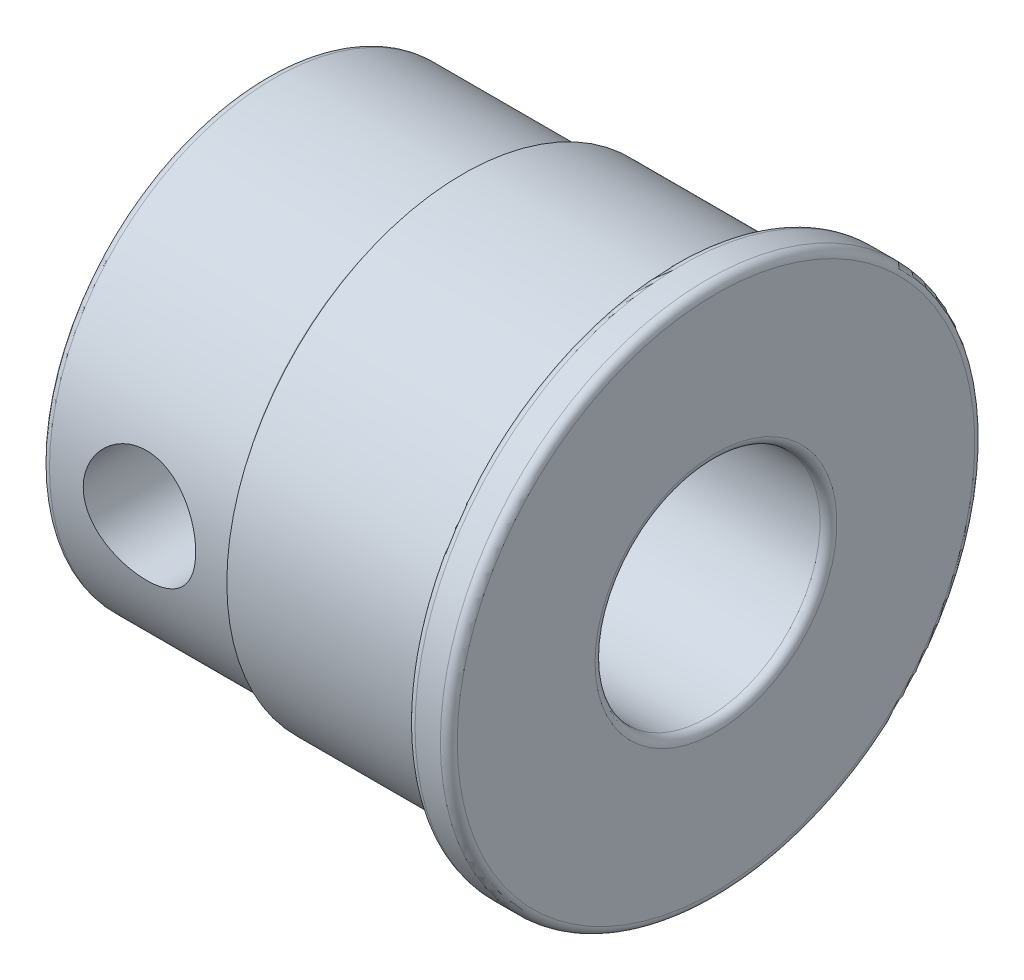
ISO-10303-21;
HEADER;
FILE_DESCRIPTION(('STEP AP214'),'2;1');
FILE_NAME('part.step','',(''),(''),'','','');
FILE_SCHEMA(('AUTOMOTIVE_DESIGN { 1 0 10303 214 1 1 1 1 }'));
ENDSEC;
DATA;
#1=APPLICATION_CONTEXT('core data for automotive mechanical design processes');
#2=APPLICATION_PROTOCOL_DEFINITION('international standard','automotive_design',2000,#1);
#3=PRODUCT_CONTEXT('',#1,'mechanical');
#4=PRODUCT('Part','Part','',(#3));
#5=PRODUCT_RELATED_PRODUCT_CATEGORY('part','',(#4));
#6=PRODUCT_DEFINITION_FORMATION('','',#4);
#7=PRODUCT_DEFINITION_CONTEXT('part definition',#1,'design');
#8=PRODUCT_DEFINITION('design','',#6,#7);
#9=PRODUCT_DEFINITION_SHAPE('','',#8);
#10=(LENGTH_UNIT() NAMED_UNIT(*) SI_UNIT(.MILLI.,.METRE.));
#11=(NAMED_UNIT(*) PLANE_ANGLE_UNIT() SI_UNIT($,.RADIAN.));
#12=(NAMED_UNIT(*) SI_UNIT($,.STERADIAN.) SOLID_ANGLE_UNIT());
#13=UNCERTAINTY_MEASURE_WITH_UNIT(LENGTH_MEASURE(1.E-05),#10,'distance_accuracy_value','');
#14=(GEOMETRIC_REPRESENTATION_CONTEXT(3) GLOBAL_UNCERTAINTY_ASSIGNED_CONTEXT((#13)) GLOBAL_UNIT_ASSIGNED_CONTEXT((#10,
#11,#12)) REPRESENTATION_CONTEXT('',''));
#15=CARTESIAN_POINT('',(0.,0.,0.));
#16=DIRECTION('',(0.,0.,1.));
#17=DIRECTION('',(1.,0.,0.));
#18=AXIS2_PLACEMENT_3D('',#15,#16,#17);
#19=CARTESIAN_POINT('',(0.,0.,0.));
#20=DIRECTION('',(-1.,0.,0.));
#21=DIRECTION('',(0.,0.,1.));
#22=AXIS2_PLACEMENT_3D('',#19,#20,#21);
#23=CYLINDRICAL_SURFACE('',#22,4.);
#24=CARTESIAN_POINT('',(5.5,0.,4.));
#25=CARTESIAN_POINT('',(5.49999339536562,0.105143925902467,3.99999426810082));
#26=CARTESIAN_POINT('',(5.49165985375789,0.210413199395125,3.99580982039513));
#27=CARTESIAN_POINT('',(5.45869423931692,0.417840470537792,3.97948312074314));
#28=CARTESIAN_POINT('',(5.43403121400437,0.519992173427259,3.96732575657839));
#29=CARTESIAN_POINT('',(5.36961238276674,0.717867089760898,3.93632558806751));
#30=CARTESIAN_POINT('',(5.32991523150406,0.813613605878293,3.91750878355075));
#31=CARTESIAN_POINT('',(5.23685875727003,0.996945233613198,3.87491553031523));
#32=CARTESIAN_POINT('',(5.18350051150227,1.08453098798012,3.85113947267051));
#33=CARTESIAN_POINT('',(5.06096550102943,1.25501563552382,3.79912516516124));
#34=CARTESIAN_POINT('',(4.99102704152072,1.33731042224422,3.77070398255074));
#35=CARTESIAN_POINT('',(4.83895704150593,1.48955888973396,3.71319940493486));
#36=CARTESIAN_POINT('',(4.75681629645512,1.55950316621354,3.68411552418069));
#37=CARTESIAN_POINT('',(4.57503330095324,1.69050400090056,3.62597902394695));
#38=CARTESIAN_POINT('',(4.47452780330817,1.75045067110328,3.59710373940264));
#39=CARTESIAN_POINT('',(4.26326532802757,1.85233645378139,3.54571957544641));
#40=CARTESIAN_POINT('',(4.1525157425545,1.89428842993267,3.52320615213979));
#41=CARTESIAN_POINT('',(3.93066978915616,1.95626488437718,3.48915734075617));
#42=CARTESIAN_POINT('',(3.81999109586521,1.97745171416088,3.47704543167427));
#43=CARTESIAN_POINT('',(3.59604232444105,2.00085398661769,3.46363779897055));
#44=CARTESIAN_POINT('',(3.48277491825769,2.00308817674615,3.46233138686576));
#45=CARTESIAN_POINT('',(3.27142795136926,1.98937457434459,3.47021860514497));
#46=CARTESIAN_POINT('',(3.1731519375539,1.97556911907364,3.47817527324027));
#47=CARTESIAN_POINT('',(2.98055618125392,1.93387969811386,3.50152457467701));
#48=CARTESIAN_POINT('',(2.88623770938937,1.9059912477953,3.51691957663553));
#49=CARTESIAN_POINT('',(2.70154173486868,1.83641956077201,3.55374952825482));
#50=CARTESIAN_POINT('',(2.61130720242842,1.79443013423199,3.57531681327997));
#51=CARTESIAN_POINT('',(2.43873141481998,1.698083375336,3.62206808562807));
#52=CARTESIAN_POINT('',(2.35639372879982,1.64372048762493,3.64725369560381));
#53=CARTESIAN_POINT('',(2.19095749451355,1.51613210982558,3.70226315806572));
#54=CARTESIAN_POINT('',(2.10908625284769,1.44138891673856,3.73227020473492));
#55=CARTESIAN_POINT('',(1.9585291628182,1.27911115748275,3.79095246600815));
#56=CARTESIAN_POINT('',(1.88984961593223,1.19157051314857,3.81962703917602));
#57=CARTESIAN_POINT('',(1.76462867794055,1.0010330116637,3.87403974565928));
#58=CARTESIAN_POINT('',(1.70879905510852,0.897507183198818,3.89957968324015));
#59=CARTESIAN_POINT('',(1.61580594191398,0.680932430977593,3.94315762242485));
#60=CARTESIAN_POINT('',(1.57862762996967,0.567891152530551,3.96120157887106));
#61=CARTESIAN_POINT('',(1.52704919256665,0.345532983321404,3.98648667482871));
#62=CARTESIAN_POINT('',(1.51101752850644,0.236683061096652,3.9944987660262));
#63=CARTESIAN_POINT('',(1.49707053773103,0.0175591998987035,4.00146026918207));
#64=CARTESIAN_POINT('',(1.49914662872106,-0.0927140397398174,4.00041397442637));
#65=CARTESIAN_POINT('',(1.52041337683749,-0.302465943971974,3.9898238450687));
#66=CARTESIAN_POINT('',(1.53826506545999,-0.40211881609986,3.98094491376337));
#67=CARTESIAN_POINT('',(1.58847614379024,-0.596813784603882,3.95644342629681));
#68=CARTESIAN_POINT('',(1.62083713290699,-0.691855371382174,3.94082012668824));
#69=CARTESIAN_POINT('',(1.69999693286607,-0.877777216899146,3.90368502827176));
#70=CARTESIAN_POINT('',(1.74718210023257,-0.968460794011607,3.88201763539262));
#71=CARTESIAN_POINT('',(1.85421507129314,-1.14092272339854,3.83487948634835));
#72=CARTESIAN_POINT('',(1.91406826919079,-1.22269725955318,3.80940711133877));
#73=CARTESIAN_POINT('',(2.05152085066143,-1.38353537857843,3.75416442672396));
#74=CARTESIAN_POINT('',(2.13028573689029,-1.46154415563805,3.72421769686999));
#75=CARTESIAN_POINT('',(2.29985030255546,-1.60371264223771,3.6652478321764));
#76=CARTESIAN_POINT('',(2.39065823769584,-1.66786277142375,3.63622534800094));
#77=CARTESIAN_POINT('',(2.58728730834595,-1.78341582895804,3.58102384412979));
#78=CARTESIAN_POINT('',(2.69362253218896,-1.8340509916005,3.55505059178121));
#79=CARTESIAN_POINT('',(2.91502013514993,-1.91616565186941,3.51148144588269));
#80=CARTESIAN_POINT('',(3.03007105293378,-1.94766983173403,3.493874764435));
#81=CARTESIAN_POINT('',(3.25382044576941,-1.98772337493374,3.47123002051604));
#82=CARTESIAN_POINT('',(3.36206850687048,-1.9981859928109,3.4651476693013));
#83=CARTESIAN_POINT('',(3.57889413432905,-2.0013783087524,3.46330709283207));
#84=CARTESIAN_POINT('',(3.68747153747572,-1.99411569324648,3.4675443925278));
#85=CARTESIAN_POINT('',(3.89096700306688,-1.96385225118662,3.48475724102153));
#86=CARTESIAN_POINT('',(3.98620094028948,-1.94241662868607,3.49686188965317));
#87=CARTESIAN_POINT('',(4.17161623884873,-1.88635071644882,3.52742032375305));
#88=CARTESIAN_POINT('',(4.26179596418406,-1.85171618231984,3.54587615139337));
#89=CARTESIAN_POINT('',(4.44124970197307,-1.76763149060113,3.58857060729071));
#90=CARTESIAN_POINT('',(4.53005580365806,-1.7173422756314,3.61311444791841));
#91=CARTESIAN_POINT('',(4.69854907236252,-1.60430194327478,3.66470663269721));
#92=CARTESIAN_POINT('',(4.77823146104222,-1.54154434248312,3.69175627591221));
#93=CARTESIAN_POINT('',(4.93628396470935,-1.39640665332275,3.74924646316184));
#94=CARTESIAN_POINT('',(5.01331820470058,-1.31256884599452,3.77969966613256));
#95=CARTESIAN_POINT('',(5.15252596687054,-1.13230961246639,3.83755504519861));
#96=CARTESIAN_POINT('',(5.21469147893981,-1.03588144661039,3.8649555725239));
#97=CARTESIAN_POINT('',(5.32247272542414,-0.831863193565891,3.91396019133075));
#98=CARTESIAN_POINT('',(5.36796833847294,-0.724199007553461,3.93552192987866));
#99=CARTESIAN_POINT('',(5.43961633551482,-0.501484202276173,3.97002682597974));
#100=CARTESIAN_POINT('',(5.46582369361143,-0.3864555991782,3.98299446726136));
#101=CARTESIAN_POINT('',(5.48779482217148,-0.225203892981791,3.99390923826956));
#102=CARTESIAN_POINT('',(5.49236528173268,-0.18032375888313,3.99618730680502));
#103=CARTESIAN_POINT('',(5.49846933102817,-0.0903034636101833,3.99923393953631));
#104=CARTESIAN_POINT('',(5.50000283694042,-0.045163295293257,4.00000246206762));
#105=CARTESIAN_POINT('',(5.5,0.,4.));
#106=B_SPLINE_CURVE_WITH_KNOTS('',3,(#24,#25,#26,#27,#28,#29,#30,#31,#32,#33,#34,#35,#36,#37,
#38,#39,#40,#41,#42,#43,#44,#45,#46,#47,#48,#49,#50,#51,#52,#53,#54,#55,#56,#57,#58,#59,#60,#61,
#62,#63,#64,#65,#66,#67,#68,#69,#70,#71,#72,#73,#74,#75,#76,#77,#78,#79,#80,#81,#82,#83,#84,#85,
#86,#87,#88,#89,#90,#91,#92,#93,#94,#95,#96,#97,#98,#99,#100,#101,#102,#103,#104,#105),
.UNSPECIFIED.,.T.,.F.,(4,2,2,2,2,2,2,2,2,2,2,2,2,2,2,2,2,2,2,2,2,2,2,2,2,2,2,2,2,2,2,2,2,2,2,2,
2,2,2,2,4),(0.,0.315248514840585,0.631096299418396,0.945724310984597,1.26032752116314,
1.59396351743618,1.92785247530807,2.28763452861505,2.64715895796562,2.98516024280459,
3.32282714658041,3.62011424818641,3.91749607851357,4.22180480336975,4.52625042520444,
4.86929882667757,5.21251069197373,5.57166044428881,5.93052433824559,6.25966580942691,
6.58865129022952,6.89213813012244,7.19565843261863,7.50785712055797,7.82018901496678,
8.16319221288838,8.50643177230864,8.86629364323452,9.22569023890901,9.55058615006093,
9.87534119729357,10.1691586049771,10.463070575767,10.7767291356057,11.0905512228726,
11.4425048551434,11.7946476676249,12.1492802732705,12.502898172423,12.6383056026783,
12.7737167702213),.UNSPECIFIED.);
#107=CARTESIAN_POINT('',(5.5,0.,4.));
#108=VERTEX_POINT('',#107);
#109=EDGE_CURVE('E90',#108,#108,#106,.T.);
#110=ORIENTED_EDGE('',*,*,#109,.T.);
#111=EDGE_LOOP('',(#110));
#112=FACE_BOUND('',#111,.T.);
#113=CARTESIAN_POINT('',(5.5,0.,-4.));
#114=CARTESIAN_POINT('',(5.49999339536562,-0.105143925902467,-3.99999426810082));
#115=CARTESIAN_POINT('',(5.49165985375789,-0.210413199395125,-3.99580982039513));
#116=CARTESIAN_POINT('',(5.45869423931692,-0.417840470537792,-3.97948312074314));
#117=CARTESIAN_POINT('',(5.43403121400437,-0.519992173427259,-3.96732575657839));
#118=CARTESIAN_POINT('',(5.36961238276674,-0.717867089760898,-3.93632558806751));
#119=CARTESIAN_POINT('',(5.32991523150406,-0.813613605878293,-3.91750878355075));
#120=CARTESIAN_POINT('',(5.23685875727003,-0.996945233613198,-3.87491553031523));
#121=CARTESIAN_POINT('',(5.18350051150227,-1.08453098798012,-3.85113947267051));
#122=CARTESIAN_POINT('',(5.06096550102943,-1.25501563552382,-3.79912516516124));
#123=CARTESIAN_POINT('',(4.99102704152072,-1.33731042224422,-3.77070398255074));
#124=CARTESIAN_POINT('',(4.83895704150593,-1.48955888973396,-3.71319940493486));
#125=CARTESIAN_POINT('',(4.75681629645512,-1.55950316621354,-3.68411552418069));
#126=CARTESIAN_POINT('',(4.57503330095324,-1.69050400090056,-3.62597902394695));
#127=CARTESIAN_POINT('',(4.47452780330817,-1.75045067110328,-3.59710373940264));
#128=CARTESIAN_POINT('',(4.26326532802757,-1.85233645378139,-3.54571957544641));
#129=CARTESIAN_POINT('',(4.1525157425545,-1.89428842993267,-3.52320615213979));
#130=CARTESIAN_POINT('',(3.93066978915616,-1.95626488437718,-3.48915734075617));
#131=CARTESIAN_POINT('',(3.81999109586521,-1.97745171416088,-3.47704543167427));
#132=CARTESIAN_POINT('',(3.59604232444105,-2.00085398661769,-3.46363779897055));
#133=CARTESIAN_POINT('',(3.48277491825769,-2.00308817674615,-3.46233138686576));
#134=CARTESIAN_POINT('',(3.27142795136926,-1.98937457434459,-3.47021860514497));
#135=CARTESIAN_POINT('',(3.1731519375539,-1.97556911907364,-3.47817527324027));
#136=CARTESIAN_POINT('',(2.98055618125392,-1.93387969811386,-3.50152457467701));
#137=CARTESIAN_POINT('',(2.88623770938937,-1.9059912477953,-3.51691957663553));
#138=CARTESIAN_POINT('',(2.70154173486868,-1.83641956077201,-3.55374952825482));
#139=CARTESIAN_POINT('',(2.61130720242842,-1.79443013423199,-3.57531681327997));
#140=CARTESIAN_POINT('',(2.43873141481998,-1.698083375336,-3.62206808562807));
#141=CARTESIAN_POINT('',(2.35639372879982,-1.64372048762493,-3.64725369560381));
#142=CARTESIAN_POINT('',(2.19095749451355,-1.51613210982558,-3.70226315806572));
#143=CARTESIAN_POINT('',(2.10908625284769,-1.44138891673856,-3.73227020473492));
#144=CARTESIAN_POINT('',(1.9585291628182,-1.27911115748275,-3.79095246600815));
#145=CARTESIAN_POINT('',(1.88984961593223,-1.19157051314857,-3.81962703917602));
#146=CARTESIAN_POINT('',(1.76462867794055,-1.0010330116637,-3.87403974565928));
#147=CARTESIAN_POINT('',(1.70879905510852,-0.897507183198818,-3.89957968324015));
#148=CARTESIAN_POINT('',(1.61580594191398,-0.680932430977593,-3.94315762242485));
#149=CARTESIAN_POINT('',(1.57862762996967,-0.567891152530551,-3.96120157887106));
#150=CARTESIAN_POINT('',(1.52704919256665,-0.345532983321404,-3.98648667482871));
#151=CARTESIAN_POINT('',(1.51101752850644,-0.236683061096652,-3.9944987660262));
#152=CARTESIAN_POINT('',(1.49707053773103,-0.0175591998987035,-4.00146026918207));
#153=CARTESIAN_POINT('',(1.49914662872106,0.0927140397398174,-4.00041397442637));
#154=CARTESIAN_POINT('',(1.52041337683749,0.302465943971974,-3.9898238450687));
#155=CARTESIAN_POINT('',(1.53826506545999,0.40211881609986,-3.98094491376337));
#156=CARTESIAN_POINT('',(1.58847614379024,0.596813784603882,-3.95644342629681));
#157=CARTESIAN_POINT('',(1.62083713290699,0.691855371382174,-3.94082012668824));
#158=CARTESIAN_POINT('',(1.69999693286607,0.877777216899146,-3.90368502827176));
#159=CARTESIAN_POINT('',(1.74718210023257,0.968460794011607,-3.88201763539262));
#160=CARTESIAN_POINT('',(1.85421507129314,1.14092272339854,-3.83487948634835));
#161=CARTESIAN_POINT('',(1.91406826919079,1.22269725955318,-3.80940711133877));
#162=CARTESIAN_POINT('',(2.05152085066143,1.38353537857843,-3.75416442672396));
#163=CARTESIAN_POINT('',(2.13028573689029,1.46154415563805,-3.72421769686999));
#164=CARTESIAN_POINT('',(2.29985030255546,1.60371264223771,-3.6652478321764));
#165=CARTESIAN_POINT('',(2.39065823769584,1.66786277142375,-3.63622534800094));
#166=CARTESIAN_POINT('',(2.58728730834595,1.78341582895804,-3.58102384412979));
#167=CARTESIAN_POINT('',(2.69362253218896,1.8340509916005,-3.55505059178121));
#168=CARTESIAN_POINT('',(2.91502013514993,1.91616565186941,-3.51148144588269));
#169=CARTESIAN_POINT('',(3.03007105293378,1.94766983173403,-3.493874764435));
#170=CARTESIAN_POINT('',(3.25382044576941,1.98772337493374,-3.47123002051604));
#171=CARTESIAN_POINT('',(3.36206850687048,1.9981859928109,-3.4651476693013));
#172=CARTESIAN_POINT('',(3.57889413432905,2.0013783087524,-3.46330709283207));
#173=CARTESIAN_POINT('',(3.68747153747572,1.99411569324648,-3.4675443925278));
#174=CARTESIAN_POINT('',(3.89096700306688,1.96385225118662,-3.48475724102153));
#175=CARTESIAN_POINT('',(3.98620094028948,1.94241662868607,-3.49686188965317));
#176=CARTESIAN_POINT('',(4.17161623884873,1.88635071644882,-3.52742032375305));
#177=CARTESIAN_POINT('',(4.26179596418406,1.85171618231984,-3.54587615139337));
#178=CARTESIAN_POINT('',(4.44124970197307,1.76763149060113,-3.58857060729071));
#179=CARTESIAN_POINT('',(4.53005580365806,1.7173422756314,-3.61311444791841));
#180=CARTESIAN_POINT('',(4.69854907236252,1.60430194327478,-3.66470663269721));
#181=CARTESIAN_POINT('',(4.77823146104222,1.54154434248312,-3.69175627591221));
#182=CARTESIAN_POINT('',(4.93628396470935,1.39640665332275,-3.74924646316184));
#183=CARTESIAN_POINT('',(5.01331820470058,1.31256884599452,-3.77969966613256));
#184=CARTESIAN_POINT('',(5.15252596687054,1.13230961246639,-3.83755504519861));
#185=CARTESIAN_POINT('',(5.21469147893981,1.03588144661039,-3.8649555725239));
#186=CARTESIAN_POINT('',(5.32247272542414,0.831863193565891,-3.91396019133075));
#187=CARTESIAN_POINT('',(5.36796833847294,0.724199007553461,-3.93552192987866));
#188=CARTESIAN_POINT('',(5.43961633551482,0.501484202276173,-3.97002682597974));
#189=CARTESIAN_POINT('',(5.46582369361143,0.3864555991782,-3.98299446726136));
#190=CARTESIAN_POINT('',(5.48779482217148,0.225203892981791,-3.99390923826956));
#191=CARTESIAN_POINT('',(5.49236528173268,0.18032375888313,-3.99618730680502));
#192=CARTESIAN_POINT('',(5.49846933102817,0.0903034636101833,-3.99923393953631));
#193=CARTESIAN_POINT('',(5.50000283694042,0.045163295293257,-4.00000246206762));
#194=CARTESIAN_POINT('',(5.5,0.,-4.));
#195=B_SPLINE_CURVE_WITH_KNOTS('',3,(#113,#114,#115,#116,#117,#118,#119,#120,#121,#122,#123,
#124,#125,#126,#127,#128,#129,#130,#131,#132,#133,#134,#135,#136,#137,#138,#139,#140,#141,#142,
#143,#144,#145,#146,#147,#148,#149,#150,#151,#152,#153,#154,#155,#156,#157,#158,#159,#160,#161,
#162,#163,#164,#165,#166,#167,#168,#169,#170,#171,#172,#173,#174,#175,#176,#177,#178,#179,#180,
#181,#182,#183,#184,#185,#186,#187,#188,#189,#190,#191,#192,#193,#194),.UNSPECIFIED.,.T.,.F.,(4,
2,2,2,2,2,2,2,2,2,2,2,2,2,2,2,2,2,2,2,2,2,2,2,2,2,2,2,2,2,2,2,2,2,2,2,2,2,2,2,4),(0.,
0.315248514840585,0.631096299418396,0.945724310984597,1.26032752116314,1.59396351743618,
1.92785247530807,2.28763452861505,2.64715895796562,2.98516024280459,3.32282714658041,
3.62011424818641,3.91749607851357,4.22180480336975,4.52625042520444,4.86929882667757,
5.21251069197373,5.57166044428881,5.93052433824559,6.25966580942691,6.58865129022952,
6.89213813012244,7.19565843261863,7.50785712055797,7.82018901496678,8.16319221288838,
8.50643177230864,8.86629364323452,9.22569023890901,9.55058615006093,9.87534119729357,
10.1691586049771,10.463070575767,10.7767291356057,11.0905512228726,11.4425048551434,
11.7946476676249,12.1492802732705,12.502898172423,12.6383056026783,12.7737167702213),.UNSPECIFIED.);
#196=CARTESIAN_POINT('',(5.5,0.,-4.));
#197=VERTEX_POINT('',#196);
#198=EDGE_CURVE('E83',#197,#197,#195,.T.);
#199=ORIENTED_EDGE('',*,*,#198,.T.);
#200=EDGE_LOOP('',(#199));
#201=FACE_BOUND('',#200,.T.);
#202=CARTESIAN_POINT('',(0.3,0.,0.));
#203=DIRECTION('',(1.,0.,0.));
#204=DIRECTION('',(0.,0.,-1.));
#205=AXIS2_PLACEMENT_3D('',#202,#203,#204);
#206=CIRCLE('',#205,4.);
#207=CARTESIAN_POINT('',(0.3,0.,-4.));
#208=VERTEX_POINT('',#207);
#209=EDGE_CURVE('E162',#208,#208,#206,.F.);
#210=ORIENTED_EDGE('',*,*,#209,.T.);
#211=EDGE_LOOP('',(#210));
#212=FACE_BOUND('',#211,.T.);
#213=CARTESIAN_POINT('',(15.7,0.,0.));
#214=DIRECTION('',(-1.,0.,0.));
#215=DIRECTION('',(0.,0.,1.));
#216=AXIS2_PLACEMENT_3D('',#213,#214,#215);
#217=CIRCLE('',#216,4.);
#218=CARTESIAN_POINT('',(15.7,0.,4.));
#219=VERTEX_POINT('',#218);
#220=EDGE_CURVE('E166',#219,#219,#217,.F.);
#221=ORIENTED_EDGE('',*,*,#220,.T.);
#222=EDGE_LOOP('',(#221));
#223=FACE_BOUND('',#222,.T.);
#224=ADVANCED_FACE('F37',(#112,#201,#212,#223),#23,.F.);
#225=CARTESIAN_POINT('',(0.,0.,-4.));
#226=DIRECTION('',(1.,0.,0.));
#227=DIRECTION('',(0.,0.,-1.));
#228=AXIS2_PLACEMENT_3D('',#225,#226,#227);
#229=PLANE('',#228);
#230=CARTESIAN_POINT('',(0.,0.,0.));
#231=DIRECTION('',(1.,0.,0.));
#232=DIRECTION('',(0.,0.,-1.));
#233=AXIS2_PLACEMENT_3D('',#230,#231,#232);
#234=CIRCLE('',#233,4.3);
#235=CARTESIAN_POINT('',(0.,0.,-4.3));
#236=VERTEX_POINT('',#235);
#237=EDGE_CURVE('E154',#236,#236,#234,.T.);
#238=ORIENTED_EDGE('',*,*,#237,.T.);
#239=EDGE_LOOP('',(#238));
#240=FACE_BOUND('',#239,.T.);
#241=CARTESIAN_POINT('',(0.,0.,0.));
#242=DIRECTION('',(1.,0.,0.));
#243=DIRECTION('',(0.,0.,-1.));
#244=AXIS2_PLACEMENT_3D('',#241,#242,#243);
#245=CIRCLE('',#244,7.7);
#246=CARTESIAN_POINT('',(0.,0.,-7.7));
#247=VERTEX_POINT('',#246);
#248=EDGE_CURVE('E158',#247,#247,#245,.F.);
#249=ORIENTED_EDGE('',*,*,#248,.T.);
#250=EDGE_LOOP('',(#249));
#251=FACE_BOUND('',#250,.T.);
#252=ADVANCED_FACE('F98',(#240,#251),#229,.F.);
#253=CARTESIAN_POINT('',(0.,0.,0.));
#254=DIRECTION('',(-1.,0.,0.));
#255=DIRECTION('',(0.,0.,1.));
#256=AXIS2_PLACEMENT_3D('',#253,#254,#255);
#257=CYLINDRICAL_SURFACE('',#256,8.);
#258=CARTESIAN_POINT('',(5.5,0.,8.));
#259=CARTESIAN_POINT('',(5.49999689901579,-0.110501451559641,7.9999981315735));
#260=CARTESIAN_POINT('',(5.49081126563495,-0.221037543774351,7.99768770842435));
#261=CARTESIAN_POINT('',(5.45436646492399,-0.438941765027377,7.98869485106526));
#262=CARTESIAN_POINT('',(5.42709705394953,-0.546308062494319,7.98200993893301));
#263=CARTESIAN_POINT('',(5.35541432871722,-0.754694496243436,7.96500835109376));
#264=CARTESIAN_POINT('',(5.31102160171298,-0.855722084573336,7.95469603789411));
#265=CARTESIAN_POINT('',(5.20642481327354,-1.04889617587257,7.93153791743495));
#266=CARTESIAN_POINT('',(5.14622021850804,-1.14104237913168,7.91869202472209));
#267=CARTESIAN_POINT('',(5.01039894712776,-1.31573590306789,7.89156551455591));
#268=CARTESIAN_POINT('',(4.93451790005459,-1.39807425341474,7.87726276197502));
#269=CARTESIAN_POINT('',(4.77006372678795,-1.54899856960443,7.84898160157248));
#270=CARTESIAN_POINT('',(4.68148916940409,-1.61758298259892,7.83500323053157));
#271=CARTESIAN_POINT('',(4.49253969768401,-1.74003539039863,7.80873034264225));
#272=CARTESIAN_POINT('',(4.39200902558836,-1.79366962123352,7.79646392619748));
#273=CARTESIAN_POINT('',(4.18300211778662,-1.88319587806766,7.77532659757355));
#274=CARTESIAN_POINT('',(4.07452715555731,-1.91909074058685,7.76645514259225));
#275=CARTESIAN_POINT('',(3.85500866906445,-1.97140644907302,7.7533396892843));
#276=CARTESIAN_POINT('',(3.74406013861601,-1.98820302444274,7.74900654662681));
#277=CARTESIAN_POINT('',(3.52084190800087,-2.00301570008854,7.74519149946122));
#278=CARTESIAN_POINT('',(3.40857242574382,-2.00103485575748,7.74570880570571));
#279=CARTESIAN_POINT('',(3.1887789230062,-1.97864869951961,7.75145607355756));
#280=CARTESIAN_POINT('',(3.08120583804623,-1.95869112025418,7.75657150676391));
#281=CARTESIAN_POINT('',(2.87098526545192,-1.90163224920399,7.77075612894758));
#282=CARTESIAN_POINT('',(2.76833812929477,-1.86452973609252,7.77982559958985));
#283=CARTESIAN_POINT('',(2.56968264499716,-1.77385263724958,7.80100151874212));
#284=CARTESIAN_POINT('',(2.47375177094724,-1.72011555631056,7.81313769959755));
#285=CARTESIAN_POINT('',(2.29210838699091,-1.59780836801993,7.83906281127988));
#286=CARTESIAN_POINT('',(2.20639766924367,-1.52923566507845,7.85285203112837));
#287=CARTESIAN_POINT('',(2.04506184574079,-1.37688456624163,7.88101174053188));
#288=CARTESIAN_POINT('',(1.96979401325153,-1.29272834422115,7.89538759304001));
#289=CARTESIAN_POINT('',(1.8343716767148,-1.11281589000493,7.92274620771675));
#290=CARTESIAN_POINT('',(1.77421763431525,-1.01705930361059,7.93572892732543));
#291=CARTESIAN_POINT('',(1.67059921836749,-0.816154518241856,7.9589030945892));
#292=CARTESIAN_POINT('',(1.62719287966076,-0.710975190944832,7.96908480170303));
#293=CARTESIAN_POINT('',(1.55877692572057,-0.494501344190511,7.98543889321888));
#294=CARTESIAN_POINT('',(1.53376379144248,-0.383207998867313,7.99161204452374));
#295=CARTESIAN_POINT('',(1.50338991258822,-0.160719960520036,7.999139990285));
#296=CARTESIAN_POINT('',(1.4975426318996,-0.0495956266509467,8.00061404677705));
#297=CARTESIAN_POINT('',(1.50433200274065,0.172043833068677,7.99891739752601));
#298=CARTESIAN_POINT('',(1.51696699039884,0.28255901285946,7.99574710989128));
#299=CARTESIAN_POINT('',(1.55996121118851,0.498152358368655,7.98519441503143));
#300=CARTESIAN_POINT('',(1.59005501796932,0.603286825291672,7.97787512247748));
#301=CARTESIAN_POINT('',(1.66680944537126,0.807009723270015,7.95984942178845));
#302=CARTESIAN_POINT('',(1.71347173908423,0.905597492043513,7.94914267159856));
#303=CARTESIAN_POINT('',(1.8229815051663,1.0953641792398,7.92524410568414));
#304=CARTESIAN_POINT('',(1.88610148319568,1.18638058911444,7.91201156489243));
#305=CARTESIAN_POINT('',(2.02638654506263,1.35670215152433,7.88459345583226));
#306=CARTESIAN_POINT('',(2.10355405282254,1.43600527863068,7.87040772335606));
#307=CARTESIAN_POINT('',(2.27200261445929,1.58265409076364,7.84225275947695));
#308=CARTESIAN_POINT('',(2.36358360400323,1.64965849016271,7.82829738916375));
#309=CARTESIAN_POINT('',(2.55697684595429,1.7673476786836,7.80257171169652));
#310=CARTESIAN_POINT('',(2.65878864394634,1.81803319221058,7.79080130756035));
#311=CARTESIAN_POINT('',(2.8692076298841,1.90126856081239,7.77090792979553));
#312=CARTESIAN_POINT('',(2.97777017112535,1.93392586220542,7.76276340389207));
#313=CARTESIAN_POINT('',(3.19907951718548,1.98046087993837,7.75102325453578));
#314=CARTESIAN_POINT('',(3.31182540137665,1.99434270330488,7.74742663626581));
#315=CARTESIAN_POINT('',(3.53482803180694,2.00271812044533,7.74526534938609));
#316=CARTESIAN_POINT('',(3.64506324683297,1.99775719704016,7.74655910304352));
#317=CARTESIAN_POINT('',(3.86307185155731,1.96983637108382,7.7537054534379));
#318=CARTESIAN_POINT('',(3.97084529068487,1.94687683024903,7.75955795855809));
#319=CARTESIAN_POINT('',(4.18027794542055,1.88390842592373,7.77508347576963));
#320=CARTESIAN_POINT('',(4.28196974032028,1.84400187290717,7.78473353648412));
#321=CARTESIAN_POINT('',(4.47728717695159,1.74835321814009,7.80677007633105));
#322=CARTESIAN_POINT('',(4.57091169758255,1.69260892004559,7.81915693494364));
#323=CARTESIAN_POINT('',(4.75007283866936,1.56515699818285,7.84567512351349));
#324=CARTESIAN_POINT('',(4.83533476456528,1.49307088388301,7.85984353109009));
#325=CARTESIAN_POINT('',(4.99272939306054,1.33571916158631,7.88810702995048));
#326=CARTESIAN_POINT('',(5.06485897348396,1.25045042834819,7.90220210302746));
#327=CARTESIAN_POINT('',(5.19521507808614,1.06729011560345,7.92903540863551));
#328=CARTESIAN_POINT('',(5.25316615156211,0.969197896421849,7.94174444487824));
#329=CARTESIAN_POINT('',(5.35166328392071,0.764354746013968,7.96406566633491));
#330=CARTESIAN_POINT('',(5.39222181419805,0.657610084582319,7.97368006933042));
#331=CARTESIAN_POINT('',(5.44876244043954,0.459213670991296,7.98730746087389));
#332=CARTESIAN_POINT('',(5.46793499073791,0.368506894544092,7.9920344673692));
#333=CARTESIAN_POINT('',(5.49355459149592,0.185208095381711,7.99838140309264));
#334=CARTESIAN_POINT('',(5.50000259907374,0.0926162149901553,8.00000156601192));
#335=CARTESIAN_POINT('',(5.5,0.,8.));
#336=B_SPLINE_CURVE_WITH_KNOTS('',3,(#258,#259,#260,#261,#262,#263,#264,#265,#266,#267,#268,
#269,#270,#271,#272,#273,#274,#275,#276,#277,#278,#279,#280,#281,#282,#283,#284,#285,#286,#287,
#288,#289,#290,#291,#292,#293,#294,#295,#296,#297,#298,#299,#300,#301,#302,#303,#304,#305,#306,
#307,#308,#309,#310,#311,#312,#313,#314,#315,#316,#317,#318,#319,#320,#321,#322,#323,#324,#325,
#326,#327,#328,#329,#330,#331,#332,#333,#334,#335),.UNSPECIFIED.,.T.,.F.,(4,2,2,2,2,2,2,2,2,2,2,
2,2,2,2,2,2,2,2,2,2,2,2,2,2,2,2,2,2,2,2,2,2,2,2,2,2,2,4),(0.,0.33116494996252,0.662517650351866,
0.993473203048141,1.32443992022577,1.66152580582852,1.99864972773416,2.34078196727743,
2.68285948225825,3.01808393468093,3.3532538415469,3.68029996013785,4.00736937959146,
4.337740371696,4.66816921119311,5.00802001296453,5.34788119415424,5.6889097201658,
6.02987298255951,6.36211078603463,6.69431868154751,7.02160366023144,7.34892169767481,
7.68204783424897,8.01523150681786,8.35659345610396,8.69794025003772,9.03723006156476,
9.37644564340971,9.70591707202578,10.0353818794581,10.3628853408369,10.6904342418696,
11.0265276855097,11.3627009303165,11.7049624733721,12.0469781843289,12.3245632392729,
12.6021274139515),.UNSPECIFIED.);
#337=CARTESIAN_POINT('',(5.5,0.,8.));
#338=VERTEX_POINT('',#337);
#339=EDGE_CURVE('E41',#338,#338,#336,.T.);
#340=ORIENTED_EDGE('',*,*,#339,.T.);
#341=EDGE_LOOP('',(#340));
#342=FACE_BOUND('',#341,.T.);
#343=CARTESIAN_POINT('',(5.5,0.,-8.));
#344=CARTESIAN_POINT('',(5.49999689901579,0.110501451559641,-7.9999981315735));
#345=CARTESIAN_POINT('',(5.49081126563495,0.221037543774351,-7.99768770842435));
#346=CARTESIAN_POINT('',(5.45436646492399,0.438941765027377,-7.98869485106526));
#347=CARTESIAN_POINT('',(5.42709705394953,0.546308062494319,-7.98200993893301));
#348=CARTESIAN_POINT('',(5.35541432871722,0.754694496243436,-7.96500835109376));
#349=CARTESIAN_POINT('',(5.31102160171298,0.855722084573336,-7.95469603789411));
#350=CARTESIAN_POINT('',(5.20642481327354,1.04889617587257,-7.93153791743495));
#351=CARTESIAN_POINT('',(5.14622021850804,1.14104237913168,-7.91869202472209));
#352=CARTESIAN_POINT('',(5.01039894712776,1.31573590306789,-7.89156551455591));
#353=CARTESIAN_POINT('',(4.93451790005459,1.39807425341474,-7.87726276197502));
#354=CARTESIAN_POINT('',(4.77006372678795,1.54899856960443,-7.84898160157248));
#355=CARTESIAN_POINT('',(4.68148916940409,1.61758298259892,-7.83500323053157));
#356=CARTESIAN_POINT('',(4.49253969768401,1.74003539039863,-7.80873034264225));
#357=CARTESIAN_POINT('',(4.39200902558836,1.79366962123352,-7.79646392619748));
#358=CARTESIAN_POINT('',(4.18300211778662,1.88319587806766,-7.77532659757355));
#359=CARTESIAN_POINT('',(4.07452715555731,1.91909074058685,-7.76645514259225));
#360=CARTESIAN_POINT('',(3.85500866906445,1.97140644907302,-7.7533396892843));
#361=CARTESIAN_POINT('',(3.74406013861601,1.98820302444274,-7.74900654662681));
#362=CARTESIAN_POINT('',(3.52084190800087,2.00301570008854,-7.74519149946122));
#363=CARTESIAN_POINT('',(3.40857242574382,2.00103485575748,-7.74570880570571));
#364=CARTESIAN_POINT('',(3.1887789230062,1.97864869951961,-7.75145607355756));
#365=CARTESIAN_POINT('',(3.08120583804623,1.95869112025418,-7.75657150676391));
#366=CARTESIAN_POINT('',(2.87098526545192,1.90163224920399,-7.77075612894758));
#367=CARTESIAN_POINT('',(2.76833812929477,1.86452973609252,-7.77982559958985));
#368=CARTESIAN_POINT('',(2.56968264499716,1.77385263724958,-7.80100151874212));
#369=CARTESIAN_POINT('',(2.47375177094724,1.72011555631056,-7.81313769959755));
#370=CARTESIAN_POINT('',(2.29210838699091,1.59780836801993,-7.83906281127988));
#371=CARTESIAN_POINT('',(2.20639766924367,1.52923566507845,-7.85285203112837));
#372=CARTESIAN_POINT('',(2.04506184574079,1.37688456624163,-7.88101174053188));
#373=CARTESIAN_POINT('',(1.96979401325153,1.29272834422115,-7.89538759304001));
#374=CARTESIAN_POINT('',(1.8343716767148,1.11281589000493,-7.92274620771675));
#375=CARTESIAN_POINT('',(1.77421763431525,1.01705930361059,-7.93572892732543));
#376=CARTESIAN_POINT('',(1.67059921836749,0.816154518241856,-7.9589030945892));
#377=CARTESIAN_POINT('',(1.62719287966076,0.710975190944832,-7.96908480170303));
#378=CARTESIAN_POINT('',(1.55877692572057,0.494501344190511,-7.98543889321888));
#379=CARTESIAN_POINT('',(1.53376379144248,0.383207998867313,-7.99161204452374));
#380=CARTESIAN_POINT('',(1.50338991258822,0.160719960520036,-7.999139990285));
#381=CARTESIAN_POINT('',(1.4975426318996,0.0495956266509467,-8.00061404677705));
#382=CARTESIAN_POINT('',(1.50433200274065,-0.172043833068677,-7.99891739752601));
#383=CARTESIAN_POINT('',(1.51696699039884,-0.28255901285946,-7.99574710989128));
#384=CARTESIAN_POINT('',(1.55996121118851,-0.498152358368655,-7.98519441503143));
#385=CARTESIAN_POINT('',(1.59005501796932,-0.603286825291672,-7.97787512247748));
#386=CARTESIAN_POINT('',(1.66680944537126,-0.807009723270015,-7.95984942178845));
#387=CARTESIAN_POINT('',(1.71347173908423,-0.905597492043513,-7.94914267159856));
#388=CARTESIAN_POINT('',(1.8229815051663,-1.0953641792398,-7.92524410568414));
#389=CARTESIAN_POINT('',(1.88610148319568,-1.18638058911444,-7.91201156489243));
#390=CARTESIAN_POINT('',(2.02638654506263,-1.35670215152433,-7.88459345583226));
#391=CARTESIAN_POINT('',(2.10355405282254,-1.43600527863068,-7.87040772335606));
#392=CARTESIAN_POINT('',(2.27200261445929,-1.58265409076364,-7.84225275947695));
#393=CARTESIAN_POINT('',(2.36358360400323,-1.64965849016271,-7.82829738916375));
#394=CARTESIAN_POINT('',(2.55697684595429,-1.7673476786836,-7.80257171169652));
#395=CARTESIAN_POINT('',(2.65878864394634,-1.81803319221058,-7.79080130756035));
#396=CARTESIAN_POINT('',(2.8692076298841,-1.90126856081239,-7.77090792979553));
#397=CARTESIAN_POINT('',(2.97777017112535,-1.93392586220542,-7.76276340389207));
#398=CARTESIAN_POINT('',(3.19907951718548,-1.98046087993837,-7.75102325453578));
#399=CARTESIAN_POINT('',(3.31182540137665,-1.99434270330488,-7.74742663626581));
#400=CARTESIAN_POINT('',(3.53482803180694,-2.00271812044533,-7.74526534938609));
#401=CARTESIAN_POINT('',(3.64506324683297,-1.99775719704016,-7.74655910304352));
#402=CARTESIAN_POINT('',(3.86307185155731,-1.96983637108382,-7.7537054534379));
#403=CARTESIAN_POINT('',(3.97084529068487,-1.94687683024903,-7.75955795855809));
#404=CARTESIAN_POINT('',(4.18027794542055,-1.88390842592373,-7.77508347576963));
#405=CARTESIAN_POINT('',(4.28196974032028,-1.84400187290717,-7.78473353648412));
#406=CARTESIAN_POINT('',(4.47728717695159,-1.74835321814009,-7.80677007633105));
#407=CARTESIAN_POINT('',(4.57091169758255,-1.69260892004559,-7.81915693494364));
#408=CARTESIAN_POINT('',(4.75007283866936,-1.56515699818285,-7.84567512351349));
#409=CARTESIAN_POINT('',(4.83533476456528,-1.49307088388301,-7.85984353109009));
#410=CARTESIAN_POINT('',(4.99272939306054,-1.33571916158631,-7.88810702995048));
#411=CARTESIAN_POINT('',(5.06485897348396,-1.25045042834819,-7.90220210302746));
#412=CARTESIAN_POINT('',(5.19521507808614,-1.06729011560345,-7.92903540863551));
#413=CARTESIAN_POINT('',(5.25316615156211,-0.969197896421849,-7.94174444487824));
#414=CARTESIAN_POINT('',(5.35166328392071,-0.764354746013968,-7.96406566633491));
#415=CARTESIAN_POINT('',(5.39222181419805,-0.657610084582319,-7.97368006933042));
#416=CARTESIAN_POINT('',(5.44876244043954,-0.459213670991296,-7.98730746087389));
#417=CARTESIAN_POINT('',(5.46793499073791,-0.368506894544092,-7.9920344673692));
#418=CARTESIAN_POINT('',(5.49355459149592,-0.185208095381711,-7.99838140309264));
#419=CARTESIAN_POINT('',(5.50000259907374,-0.0926162149901553,-8.00000156601192));
#420=CARTESIAN_POINT('',(5.5,0.,-8.));
#421=B_SPLINE_CURVE_WITH_KNOTS('',3,(#343,#344,#345,#346,#347,#348,#349,#350,#351,#352,#353,
#354,#355,#356,#357,#358,#359,#360,#361,#362,#363,#364,#365,#366,#367,#368,#369,#370,#371,#372,
#373,#374,#375,#376,#377,#378,#379,#380,#381,#382,#383,#384,#385,#386,#387,#388,#389,#390,#391,
#392,#393,#394,#395,#396,#397,#398,#399,#400,#401,#402,#403,#404,#405,#406,#407,#408,#409,#410,
#411,#412,#413,#414,#415,#416,#417,#418,#419,#420),.UNSPECIFIED.,.T.,.F.,(4,2,2,2,2,2,2,2,2,2,2,
2,2,2,2,2,2,2,2,2,2,2,2,2,2,2,2,2,2,2,2,2,2,2,2,2,2,2,4),(0.,0.33116494996252,0.662517650351866,
0.993473203048141,1.32443992022577,1.66152580582852,1.99864972773416,2.34078196727743,
2.68285948225825,3.01808393468093,3.3532538415469,3.68029996013785,4.00736937959146,
4.337740371696,4.66816921119311,5.00802001296453,5.34788119415424,5.6889097201658,
6.02987298255951,6.36211078603463,6.69431868154751,7.02160366023144,7.34892169767481,
7.68204783424897,8.01523150681786,8.35659345610396,8.69794025003772,9.03723006156476,
9.37644564340971,9.70591707202578,10.0353818794581,10.3628853408369,10.6904342418696,
11.0265276855097,11.3627009303165,11.7049624733721,12.0469781843289,12.3245632392729,
12.6021274139515),.UNSPECIFIED.);
#422=CARTESIAN_POINT('',(5.5,0.,-8.));
#423=VERTEX_POINT('',#422);
#424=EDGE_CURVE('E60',#423,#423,#421,.T.);
#425=ORIENTED_EDGE('',*,*,#424,.T.);
#426=EDGE_LOOP('',(#425));
#427=FACE_BOUND('',#426,.T.);
#428=CARTESIAN_POINT('',(6.7,0.,0.));
#429=DIRECTION('',(1.,0.,0.));
#430=DIRECTION('',(0.,0.,-1.));
#431=AXIS2_PLACEMENT_3D('',#428,#429,#430);
#432=CIRCLE('',#431,8.);
#433=CARTESIAN_POINT('',(6.7,0.,-8.));
#434=VERTEX_POINT('',#433);
#435=EDGE_CURVE('E51',#434,#434,#432,.F.);
#436=ORIENTED_EDGE('',*,*,#435,.T.);
#437=EDGE_LOOP('',(#436));
#438=FACE_BOUND('',#437,.T.);
#439=CARTESIAN_POINT('',(0.3,0.,0.));
#440=DIRECTION('',(1.,0.,0.));
#441=DIRECTION('',(0.,0.,-1.));
#442=AXIS2_PLACEMENT_3D('',#439,#440,#441);
#443=CIRCLE('',#442,8.);
#444=CARTESIAN_POINT('',(0.3,0.,-8.));
#445=VERTEX_POINT('',#444);
#446=EDGE_CURVE('E57',#445,#445,#443,.T.);
#447=ORIENTED_EDGE('',*,*,#446,.T.);
#448=EDGE_LOOP('',(#447));
#449=FACE_BOUND('',#448,.T.);
#450=ADVANCED_FACE('F66',(#342,#427,#438,#449),#257,.T.);
#451=CARTESIAN_POINT('',(7.,0.,-8.));
#452=DIRECTION('',(1.,0.,0.));
#453=DIRECTION('',(0.,0.,-1.));
#454=AXIS2_PLACEMENT_3D('',#451,#452,#453);
#455=PLANE('',#454);
#456=CARTESIAN_POINT('',(7.,0.,0.));
#457=DIRECTION('',(1.,0.,0.));
#458=DIRECTION('',(0.,0.,-1.));
#459=AXIS2_PLACEMENT_3D('',#456,#457,#458);
#460=CIRCLE('',#459,8.3);
#461=CARTESIAN_POINT('',(7.,0.,-8.3));
#462=VERTEX_POINT('',#461);
#463=EDGE_CURVE('E10',#462,#462,#460,.T.);
#464=ORIENTED_EDGE('',*,*,#463,.T.);
#465=EDGE_LOOP('',(#464));
#466=FACE_BOUND('',#465,.T.);
#467=CARTESIAN_POINT('',(7.,0.,0.));
#468=DIRECTION('',(-1.,0.,0.));
#469=DIRECTION('',(0.,0.,1.));
#470=AXIS2_PLACEMENT_3D('',#467,#468,#469);
#471=CIRCLE('',#470,8.3937831498787);
#472=CARTESIAN_POINT('',(7.,0.,8.3937831498787));
#473=VERTEX_POINT('',#472);
#474=EDGE_CURVE('E170',#473,#473,#471,.T.);
#475=ORIENTED_EDGE('',*,*,#474,.T.);
#476=EDGE_LOOP('',(#475));
#477=FACE_BOUND('',#476,.T.);
#478=ADVANCED_FACE('F128',(#466,#477),#455,.F.);
#479=CARTESIAN_POINT('',(0.,0.,0.));
#480=DIRECTION('',(-1.,0.,0.));
#481=DIRECTION('',(0.,0.,1.));
#482=AXIS2_PLACEMENT_3D('',#479,#480,#481);
#483=CYLINDRICAL_SURFACE('',#482,8.3937831498787);
#484=ORIENTED_EDGE('',*,*,#474,.F.);
#485=EDGE_LOOP('',(#484));
#486=FACE_BOUND('',#485,.T.);
#487=CARTESIAN_POINT('',(14.5,0.,0.));
#488=DIRECTION('',(-1.,0.,0.));
#489=DIRECTION('',(0.,0.,1.));
#490=AXIS2_PLACEMENT_3D('',#487,#488,#489);
#491=CIRCLE('',#490,8.3937831498787);
#492=CARTESIAN_POINT('',(14.5,0.,8.3937831498787));
#493=VERTEX_POINT('',#492);
#494=EDGE_CURVE('E173',#493,#493,#491,.T.);
#495=ORIENTED_EDGE('',*,*,#494,.T.);
#496=EDGE_LOOP('',(#495));
#497=FACE_BOUND('',#496,.T.);
#498=ADVANCED_FACE('F207',(#486,#497),#483,.T.);
#499=CARTESIAN_POINT('',(14.5,0.,-8.3937831498787));
#500=DIRECTION('',(1.,0.,0.));
#501=DIRECTION('',(0.,0.,-1.));
#502=AXIS2_PLACEMENT_3D('',#499,#500,#501);
#503=PLANE('',#502);
#504=CARTESIAN_POINT('',(14.5,0.,0.));
#505=DIRECTION('',(1.,0.,0.));
#506=DIRECTION('',(0.,0.,-1.));
#507=AXIS2_PLACEMENT_3D('',#504,#505,#506);
#508=CIRCLE('',#507,9.2);
#509=CARTESIAN_POINT('',(14.5,0.,-9.2));
#510=VERTEX_POINT('',#509);
#511=EDGE_CURVE('E133',#510,#510,#508,.F.);
#512=ORIENTED_EDGE('',*,*,#511,.T.);
#513=EDGE_LOOP('',(#512));
#514=FACE_BOUND('',#513,.T.);
#515=ORIENTED_EDGE('',*,*,#494,.F.);
#516=EDGE_LOOP('',(#515));
#517=FACE_BOUND('',#516,.T.);
#518=ADVANCED_FACE('F200',(#514,#517),#503,.F.);
#519=CARTESIAN_POINT('',(0.,0.,0.));
#520=DIRECTION('',(-1.,0.,0.));
#521=DIRECTION('',(0.,0.,1.));
#522=AXIS2_PLACEMENT_3D('',#519,#520,#521);
#523=CYLINDRICAL_SURFACE('',#522,9.5);
#524=CARTESIAN_POINT('',(15.7,0.,0.));
#525=DIRECTION('',(-1.,0.,0.));
#526=DIRECTION('',(0.,0.,1.));
#527=AXIS2_PLACEMENT_3D('',#524,#525,#526);
#528=CIRCLE('',#527,9.5);
#529=CARTESIAN_POINT('',(15.7,0.,9.5));
#530=VERTEX_POINT('',#529);
#531=EDGE_CURVE('E136',#530,#530,#528,.T.);
#532=ORIENTED_EDGE('',*,*,#531,.T.);
#533=EDGE_LOOP('',(#532));
#534=FACE_BOUND('',#533,.T.);
#535=CARTESIAN_POINT('',(14.8,0.,0.));
#536=DIRECTION('',(1.,0.,0.));
#537=DIRECTION('',(0.,0.,-1.));
#538=AXIS2_PLACEMENT_3D('',#535,#536,#537);
#539=CIRCLE('',#538,9.5);
#540=CARTESIAN_POINT('',(14.8,0.,-9.5));
#541=VERTEX_POINT('',#540);
#542=EDGE_CURVE('E142',#541,#541,#539,.T.);
#543=ORIENTED_EDGE('',*,*,#542,.T.);
#544=EDGE_LOOP('',(#543));
#545=FACE_BOUND('',#544,.T.);
#546=ADVANCED_FACE('F193',(#534,#545),#523,.T.);
#547=CARTESIAN_POINT('',(16.,0.,-9.5));
#548=DIRECTION('',(-1.,0.,0.));
#549=DIRECTION('',(0.,0.,1.));
#550=AXIS2_PLACEMENT_3D('',#547,#548,#549);
#551=PLANE('',#550);
#552=CARTESIAN_POINT('',(16.,0.,0.));
#553=DIRECTION('',(-1.,0.,0.));
#554=DIRECTION('',(0.,0.,1.));
#555=AXIS2_PLACEMENT_3D('',#552,#553,#554);
#556=CIRCLE('',#555,4.3);
#557=CARTESIAN_POINT('',(16.,0.,4.3));
#558=VERTEX_POINT('',#557);
#559=EDGE_CURVE('E146',#558,#558,#556,.T.);
#560=ORIENTED_EDGE('',*,*,#559,.T.);
#561=EDGE_LOOP('',(#560));
#562=FACE_BOUND('',#561,.T.);
#563=CARTESIAN_POINT('',(16.,0.,0.));
#564=DIRECTION('',(-1.,0.,0.));
#565=DIRECTION('',(0.,0.,1.));
#566=AXIS2_PLACEMENT_3D('',#563,#564,#565);
#567=CIRCLE('',#566,9.2);
#568=CARTESIAN_POINT('',(16.,0.,9.2));
#569=VERTEX_POINT('',#568);
#570=EDGE_CURVE('E150',#569,#569,#567,.F.);
#571=ORIENTED_EDGE('',*,*,#570,.T.);
#572=EDGE_LOOP('',(#571));
#573=FACE_BOUND('',#572,.T.);
#574=ADVANCED_FACE('F76',(#562,#573),#551,.F.);
#575=CARTESIAN_POINT('',(0.3,0.,0.));
#576=DIRECTION('',(1.,0.,0.));
#577=DIRECTION('',(0.,0.,-1.));
#578=AXIS2_PLACEMENT_3D('',#575,#576,#577);
#579=TOROIDAL_SURFACE('',#578,4.3,0.3);
#580=ORIENTED_EDGE('',*,*,#237,.F.);
#581=EDGE_LOOP('',(#580));
#582=FACE_BOUND('',#581,.T.);
#583=ORIENTED_EDGE('',*,*,#209,.F.);
#584=EDGE_LOOP('',(#583));
#585=FACE_BOUND('',#584,.T.);
#586=ADVANCED_FACE('F100',(#582,#585),#579,.T.);
#587=CARTESIAN_POINT('',(15.7,0.,0.));
#588=DIRECTION('',(-1.,0.,0.));
#589=DIRECTION('',(0.,0.,1.));
#590=AXIS2_PLACEMENT_3D('',#587,#588,#589);
#591=TOROIDAL_SURFACE('',#590,4.3,0.3);
#592=ORIENTED_EDGE('',*,*,#220,.F.);
#593=EDGE_LOOP('',(#592));
#594=FACE_BOUND('',#593,.T.);
#595=ORIENTED_EDGE('',*,*,#559,.F.);
#596=EDGE_LOOP('',(#595));
#597=FACE_BOUND('',#596,.T.);
#598=ADVANCED_FACE('F104',(#594,#597),#591,.T.);
#599=CARTESIAN_POINT('',(15.7,0.,0.));
#600=DIRECTION('',(-1.,0.,0.));
#601=DIRECTION('',(0.,0.,1.));
#602=AXIS2_PLACEMENT_3D('',#599,#600,#601);
#603=TOROIDAL_SURFACE('',#602,9.2,0.3);
#604=ORIENTED_EDGE('',*,*,#570,.F.);
#605=EDGE_LOOP('',(#604));
#606=FACE_BOUND('',#605,.T.);
#607=ORIENTED_EDGE('',*,*,#531,.F.);
#608=EDGE_LOOP('',(#607));
#609=FACE_BOUND('',#608,.T.);
#610=ADVANCED_FACE('F108',(#606,#609),#603,.T.);
#611=CARTESIAN_POINT('',(14.8,0.,0.));
#612=DIRECTION('',(1.,0.,0.));
#613=DIRECTION('',(0.,0.,-1.));
#614=AXIS2_PLACEMENT_3D('',#611,#612,#613);
#615=TOROIDAL_SURFACE('',#614,9.2,0.3);
#616=ORIENTED_EDGE('',*,*,#542,.F.);
#617=EDGE_LOOP('',(#616));
#618=FACE_BOUND('',#617,.T.);
#619=ORIENTED_EDGE('',*,*,#511,.F.);
#620=EDGE_LOOP('',(#619));
#621=FACE_BOUND('',#620,.T.);
#622=ADVANCED_FACE('F112',(#618,#621),#615,.T.);
#623=CARTESIAN_POINT('',(6.7,0.,0.));
#624=DIRECTION('',(1.,0.,0.));
#625=DIRECTION('',(0.,0.,-1.));
#626=AXIS2_PLACEMENT_3D('',#623,#624,#625);
#627=TOROIDAL_SURFACE('',#626,8.3,0.3);
#628=ORIENTED_EDGE('',*,*,#463,.F.);
#629=EDGE_LOOP('',(#628));
#630=FACE_BOUND('',#629,.T.);
#631=ORIENTED_EDGE('',*,*,#435,.F.);
#632=EDGE_LOOP('',(#631));
#633=FACE_BOUND('',#632,.T.);
#634=ADVANCED_FACE('F115',(#630,#633),#627,.F.);
#635=CARTESIAN_POINT('',(0.3,0.,0.));
#636=DIRECTION('',(1.,0.,0.));
#637=DIRECTION('',(0.,0.,-1.));
#638=AXIS2_PLACEMENT_3D('',#635,#636,#637);
#639=TOROIDAL_SURFACE('',#638,7.7,0.3);
#640=ORIENTED_EDGE('',*,*,#446,.F.);
#641=EDGE_LOOP('',(#640));
#642=FACE_BOUND('',#641,.T.);
#643=ORIENTED_EDGE('',*,*,#248,.F.);
#644=EDGE_LOOP('',(#643));
#645=FACE_BOUND('',#644,.T.);
#646=ADVANCED_FACE('F39',(#642,#645),#639,.T.);
#647=CARTESIAN_POINT('',(3.5,0.,-9.5));
#648=DIRECTION('',(0.,0.,1.));
#649=DIRECTION('',(1.,0.,0.));
#650=AXIS2_PLACEMENT_3D('',#647,#648,#649);
#651=CYLINDRICAL_SURFACE('',#650,2.);
#652=ORIENTED_EDGE('',*,*,#424,.F.);
#653=EDGE_LOOP('',(#652));
#654=FACE_BOUND('',#653,.T.);
#655=ORIENTED_EDGE('',*,*,#198,.F.);
#656=EDGE_LOOP('',(#655));
#657=FACE_BOUND('',#656,.T.);
#658=ADVANCED_FACE('F74',(#654,#657),#651,.F.);
#659=ORIENTED_EDGE('',*,*,#339,.F.);
#660=EDGE_LOOP('',(#659));
#661=FACE_BOUND('',#660,.T.);
#662=ORIENTED_EDGE('',*,*,#109,.F.);
#663=EDGE_LOOP('',(#662));
#664=FACE_BOUND('',#663,.T.);
#665=ADVANCED_FACE('F70',(#661,#664),#651,.F.);
#666=CLOSED_SHELL('',(#224,#252,#450,#478,#498,#518,#546,#574,#586,#598,#610,#622,#634,#646,
#658,#665));
#667=MANIFOLD_SOLID_BREP('B2',#666);
#668=ADVANCED_BREP_SHAPE_REPRESENTATION('',(#18,#667),#14);
#669=SHAPE_DEFINITION_REPRESENTATION(#9,#668);
ENDSEC;
END-ISO-10303-21;
